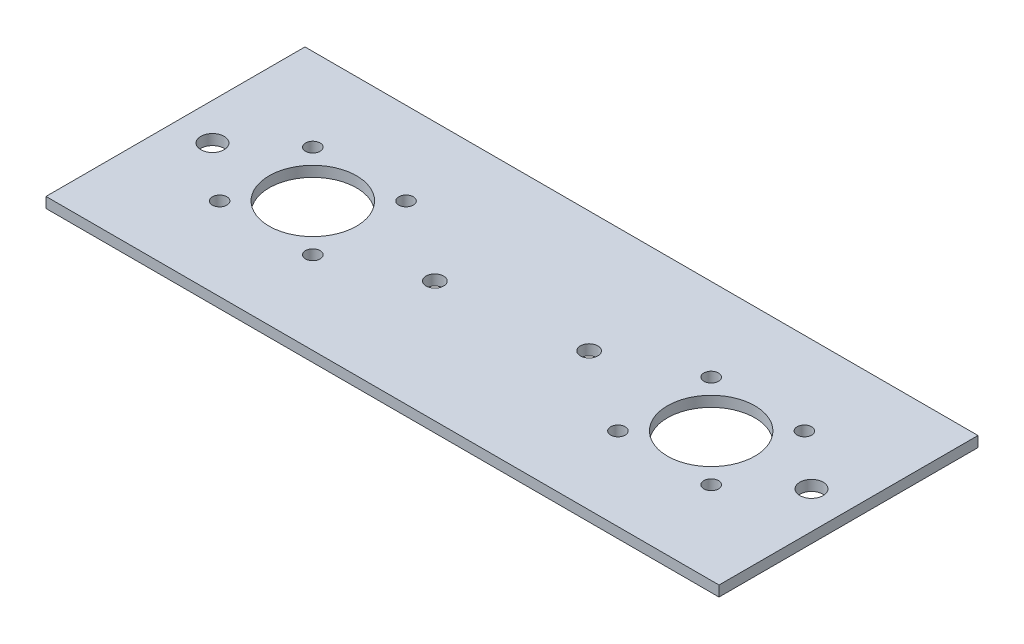
ISO-10303-21;
HEADER;
FILE_DESCRIPTION(('STEP AP214'),'2;1');
FILE_NAME('part.step','',(''),(''),'','','');
FILE_SCHEMA(('AUTOMOTIVE_DESIGN { 1 0 10303 214 1 1 1 1 }'));
ENDSEC;
DATA;
#1=APPLICATION_CONTEXT('core data for automotive mechanical design processes');
#2=APPLICATION_PROTOCOL_DEFINITION('international standard','automotive_design',2000,#1);
#3=PRODUCT_CONTEXT('',#1,'mechanical');
#4=PRODUCT('Part','Part','',(#3));
#5=PRODUCT_RELATED_PRODUCT_CATEGORY('part','',(#4));
#6=PRODUCT_DEFINITION_FORMATION('','',#4);
#7=PRODUCT_DEFINITION_CONTEXT('part definition',#1,'design');
#8=PRODUCT_DEFINITION('design','',#6,#7);
#9=PRODUCT_DEFINITION_SHAPE('','',#8);
#10=(LENGTH_UNIT() NAMED_UNIT(*) SI_UNIT(.MILLI.,.METRE.));
#11=(NAMED_UNIT(*) PLANE_ANGLE_UNIT() SI_UNIT($,.RADIAN.));
#12=(NAMED_UNIT(*) SI_UNIT($,.STERADIAN.) SOLID_ANGLE_UNIT());
#13=UNCERTAINTY_MEASURE_WITH_UNIT(LENGTH_MEASURE(1.E-05),#10,'distance_accuracy_value','');
#14=(GEOMETRIC_REPRESENTATION_CONTEXT(3) GLOBAL_UNCERTAINTY_ASSIGNED_CONTEXT((#13)) GLOBAL_UNIT_ASSIGNED_CONTEXT((#10,
#11,#12)) REPRESENTATION_CONTEXT('',''));
#15=CARTESIAN_POINT('',(0.,0.,0.));
#16=DIRECTION('',(0.,0.,1.));
#17=DIRECTION('',(1.,0.,0.));
#18=AXIS2_PLACEMENT_3D('',#15,#16,#17);
#19=CARTESIAN_POINT('',(0.,-3.6,0.));
#20=DIRECTION('',(0.,-1.,0.));
#21=DIRECTION('',(0.,0.,-1.));
#22=AXIS2_PLACEMENT_3D('',#19,#20,#21);
#23=PLANE('',#22);
#24=CARTESIAN_POINT('',(-12.7,-3.6,0.));
#25=DIRECTION('',(0.,1.,0.));
#26=DIRECTION('',(0.,0.,1.));
#27=AXIS2_PLACEMENT_3D('',#24,#25,#26);
#28=CIRCLE('',#27,3.99999999999999);
#29=CARTESIAN_POINT('',(-12.7,-3.6,3.99999999999999));
#30=VERTEX_POINT('',#29);
#31=EDGE_CURVE('E455',#30,#30,#28,.T.);
#32=ORIENTED_EDGE('',*,*,#31,.T.);
#33=EDGE_LOOP('',(#32));
#34=FACE_BOUND('',#33,.T.);
#35=CARTESIAN_POINT('',(-218.35,-3.6,0.));
#36=DIRECTION('',(0.,1.,0.));
#37=DIRECTION('',(0.,0.,1.));
#38=AXIS2_PLACEMENT_3D('',#35,#36,#37);
#39=CIRCLE('',#38,3.99999999999999);
#40=CARTESIAN_POINT('',(-218.35,-3.6,3.99999999999999));
#41=VERTEX_POINT('',#40);
#42=EDGE_CURVE('E463',#41,#41,#39,.T.);
#43=ORIENTED_EDGE('',*,*,#42,.T.);
#44=EDGE_LOOP('',(#43));
#45=FACE_BOUND('',#44,.T.);
#46=CARTESIAN_POINT('',(-91.9,-3.6,-2.85898769370838));
#47=DIRECTION('',(0.,1.,0.));
#48=DIRECTION('',(0.,0.,1.));
#49=AXIS2_PLACEMENT_3D('',#46,#47,#48);
#50=CIRCLE('',#49,3.00000000000001);
#51=CARTESIAN_POINT('',(-91.9,-3.6,0.141012306291632));
#52=VERTEX_POINT('',#51);
#53=EDGE_CURVE('E469',#52,#52,#50,.T.);
#54=ORIENTED_EDGE('',*,*,#53,.T.);
#55=EDGE_LOOP('',(#54));
#56=FACE_BOUND('',#55,.T.);
#57=CARTESIAN_POINT('',(-139.15,-3.6,2.8589876937093));
#58=DIRECTION('',(0.,1.,0.));
#59=DIRECTION('',(0.,0.,1.));
#60=AXIS2_PLACEMENT_3D('',#57,#58,#59);
#61=CIRCLE('',#60,2.99999999999999);
#62=CARTESIAN_POINT('',(-139.15,-3.6,5.85898769370929));
#63=VERTEX_POINT('',#62);
#64=EDGE_CURVE('E475',#63,#63,#61,.T.);
#65=ORIENTED_EDGE('',*,*,#64,.T.);
#66=EDGE_LOOP('',(#65));
#67=FACE_BOUND('',#66,.T.);
#68=CARTESIAN_POINT('',(-47.15,-3.6,0.));
#69=DIRECTION('',(0.,1.,0.));
#70=DIRECTION('',(0.,0.,1.));
#71=AXIS2_PLACEMENT_3D('',#68,#69,#70);
#72=CIRCLE('',#71,15.0000000000001);
#73=CARTESIAN_POINT('',(-47.15,-3.6,15.0000000000001));
#74=VERTEX_POINT('',#73);
#75=EDGE_CURVE('E481',#74,#74,#72,.T.);
#76=ORIENTED_EDGE('',*,*,#75,.T.);
#77=EDGE_LOOP('',(#76));
#78=FACE_BOUND('',#77,.T.);
#79=CARTESIAN_POINT('',(-183.9,-3.6,0.));
#80=DIRECTION('',(0.,1.,0.));
#81=DIRECTION('',(0.,0.,1.));
#82=AXIS2_PLACEMENT_3D('',#79,#80,#81);
#83=CIRCLE('',#82,14.9999999999999);
#84=CARTESIAN_POINT('',(-183.9,-3.6,14.9999999999999));
#85=VERTEX_POINT('',#84);
#86=EDGE_CURVE('E487',#85,#85,#83,.T.);
#87=ORIENTED_EDGE('',*,*,#86,.T.);
#88=EDGE_LOOP('',(#87));
#89=FACE_BOUND('',#88,.T.);
#90=CARTESIAN_POINT('',(-31.15,-3.6,-16.));
#91=DIRECTION('',(0.,1.,0.));
#92=DIRECTION('',(0.,0.,1.));
#93=AXIS2_PLACEMENT_3D('',#90,#91,#92);
#94=CIRCLE('',#93,2.49999999999999);
#95=CARTESIAN_POINT('',(-31.15,-3.6,-13.5));
#96=VERTEX_POINT('',#95);
#97=EDGE_CURVE('E493',#96,#96,#94,.T.);
#98=ORIENTED_EDGE('',*,*,#97,.T.);
#99=EDGE_LOOP('',(#98));
#100=FACE_BOUND('',#99,.T.);
#101=CARTESIAN_POINT('',(-63.15,-3.6,-16.));
#102=DIRECTION('',(0.,1.,0.));
#103=DIRECTION('',(0.,0.,1.));
#104=AXIS2_PLACEMENT_3D('',#101,#102,#103);
#105=CIRCLE('',#104,2.49999999999999);
#106=CARTESIAN_POINT('',(-63.15,-3.6,-13.5));
#107=VERTEX_POINT('',#106);
#108=EDGE_CURVE('E499',#107,#107,#105,.T.);
#109=ORIENTED_EDGE('',*,*,#108,.T.);
#110=EDGE_LOOP('',(#109));
#111=FACE_BOUND('',#110,.T.);
#112=CARTESIAN_POINT('',(-63.15,-3.6,16.000000000001));
#113=DIRECTION('',(0.,1.,0.));
#114=DIRECTION('',(0.,0.,1.));
#115=AXIS2_PLACEMENT_3D('',#112,#113,#114);
#116=CIRCLE('',#115,2.50000000000069);
#117=CARTESIAN_POINT('',(-63.15,-3.6,18.5000000000017));
#118=VERTEX_POINT('',#117);
#119=EDGE_CURVE('E505',#118,#118,#116,.T.);
#120=ORIENTED_EDGE('',*,*,#119,.T.);
#121=EDGE_LOOP('',(#120));
#122=FACE_BOUND('',#121,.T.);
#123=CARTESIAN_POINT('',(-31.15,-3.6,16.));
#124=DIRECTION('',(0.,1.,0.));
#125=DIRECTION('',(0.,0.,1.));
#126=AXIS2_PLACEMENT_3D('',#123,#124,#125);
#127=CIRCLE('',#126,2.50000000000001);
#128=CARTESIAN_POINT('',(-31.15,-3.6,18.5));
#129=VERTEX_POINT('',#128);
#130=EDGE_CURVE('E511',#129,#129,#127,.T.);
#131=ORIENTED_EDGE('',*,*,#130,.T.);
#132=EDGE_LOOP('',(#131));
#133=FACE_BOUND('',#132,.T.);
#134=CARTESIAN_POINT('',(-199.9,-3.6,-16.));
#135=DIRECTION('',(0.,-1.,0.));
#136=DIRECTION('',(0.,0.,-1.));
#137=AXIS2_PLACEMENT_3D('',#134,#135,#136);
#138=CIRCLE('',#137,2.50000000000002);
#139=CARTESIAN_POINT('',(-199.9,-3.6,-18.5));
#140=VERTEX_POINT('',#139);
#141=EDGE_CURVE('E523',#140,#140,#138,.T.);
#142=ORIENTED_EDGE('',*,*,#141,.F.);
#143=EDGE_LOOP('',(#142));
#144=FACE_BOUND('',#143,.T.);
#145=CARTESIAN_POINT('',(-167.9,-3.6,16.000000000001));
#146=DIRECTION('',(0.,-1.,0.));
#147=DIRECTION('',(0.,0.,-1.));
#148=AXIS2_PLACEMENT_3D('',#145,#146,#147);
#149=CIRCLE('',#148,2.50000000000072);
#150=CARTESIAN_POINT('',(-167.9,-3.6,13.5000000000003));
#151=VERTEX_POINT('',#150);
#152=EDGE_CURVE('E369',#151,#151,#149,.T.);
#153=ORIENTED_EDGE('',*,*,#152,.F.);
#154=EDGE_LOOP('',(#153));
#155=FACE_BOUND('',#154,.T.);
#156=DIRECTION('',(1.,0.,0.));
#157=VECTOR('',#156,1.);
#158=CARTESIAN_POINT('',(-231.05,-3.6,44.45));
#159=LINE('',#158,#157);
#160=CARTESIAN_POINT('',(-231.05,-3.6,44.45));
#161=VERTEX_POINT('',#160);
#162=CARTESIAN_POINT('',(0.,-3.6,44.45));
#163=VERTEX_POINT('',#162);
#164=EDGE_CURVE('E358',#161,#163,#159,.T.);
#165=ORIENTED_EDGE('',*,*,#164,.F.);
#166=DIRECTION('',(0.,0.,1.));
#167=VECTOR('',#166,1.);
#168=CARTESIAN_POINT('',(-231.05,-3.6,-44.45));
#169=LINE('',#168,#167);
#170=CARTESIAN_POINT('',(-231.05,-3.6,-44.45));
#171=VERTEX_POINT('',#170);
#172=EDGE_CURVE('E348',#171,#161,#169,.T.);
#173=ORIENTED_EDGE('',*,*,#172,.F.);
#174=DIRECTION('',(1.,0.,0.));
#175=VECTOR('',#174,1.);
#176=CARTESIAN_POINT('',(-231.05,-3.6,-44.45));
#177=LINE('',#176,#175);
#178=CARTESIAN_POINT('',(0.,-3.6,-44.45));
#179=VERTEX_POINT('',#178);
#180=EDGE_CURVE('E345',#171,#179,#177,.T.);
#181=ORIENTED_EDGE('',*,*,#180,.T.);
#182=DIRECTION('',(0.,0.,1.));
#183=VECTOR('',#182,1.);
#184=CARTESIAN_POINT('',(0.,-3.6,-44.45));
#185=LINE('',#184,#183);
#186=EDGE_CURVE('E342',#179,#163,#185,.T.);
#187=ORIENTED_EDGE('',*,*,#186,.T.);
#188=EDGE_LOOP('',(#165,#173,#181,#187));
#189=FACE_BOUND('',#188,.T.);
#190=CARTESIAN_POINT('',(-199.9,-3.6,16.));
#191=DIRECTION('',(0.,-1.,0.));
#192=DIRECTION('',(0.,0.,-1.));
#193=AXIS2_PLACEMENT_3D('',#190,#191,#192);
#194=CIRCLE('',#193,2.49999999999997);
#195=CARTESIAN_POINT('',(-199.9,-3.6,13.5));
#196=VERTEX_POINT('',#195);
#197=EDGE_CURVE('E529',#196,#196,#194,.T.);
#198=ORIENTED_EDGE('',*,*,#197,.F.);
#199=EDGE_LOOP('',(#198));
#200=FACE_BOUND('',#199,.T.);
#201=CARTESIAN_POINT('',(-167.9,-3.6,-16.));
#202=DIRECTION('',(0.,-1.,0.));
#203=DIRECTION('',(0.,0.,-1.));
#204=AXIS2_PLACEMENT_3D('',#201,#202,#203);
#205=CIRCLE('',#204,2.49999999999997);
#206=CARTESIAN_POINT('',(-167.9,-3.6,-18.5));
#207=VERTEX_POINT('',#206);
#208=EDGE_CURVE('E517',#207,#207,#205,.T.);
#209=ORIENTED_EDGE('',*,*,#208,.F.);
#210=EDGE_LOOP('',(#209));
#211=FACE_BOUND('',#210,.T.);
#212=ADVANCED_FACE('F299',(#34,#45,#56,#67,#78,#89,#100,#111,#122,#133,#144,#155,#189,#200,
#211),#23,.T.);
#213=CARTESIAN_POINT('',(0.,0.,0.));
#214=DIRECTION('',(0.,-1.,0.));
#215=DIRECTION('',(0.,0.,-1.));
#216=AXIS2_PLACEMENT_3D('',#213,#214,#215);
#217=PLANE('',#216);
#218=CARTESIAN_POINT('',(-12.7,0.,0.));
#219=DIRECTION('',(0.,1.,0.));
#220=DIRECTION('',(0.,0.,1.));
#221=AXIS2_PLACEMENT_3D('',#218,#219,#220);
#222=CIRCLE('',#221,3.99999999999999);
#223=CARTESIAN_POINT('',(-12.7,0.,3.99999999999999));
#224=VERTEX_POINT('',#223);
#225=EDGE_CURVE('E458',#224,#224,#222,.T.);
#226=ORIENTED_EDGE('',*,*,#225,.F.);
#227=EDGE_LOOP('',(#226));
#228=FACE_BOUND('',#227,.T.);
#229=CARTESIAN_POINT('',(-218.35,0.,0.));
#230=DIRECTION('',(0.,1.,0.));
#231=DIRECTION('',(0.,0.,1.));
#232=AXIS2_PLACEMENT_3D('',#229,#230,#231);
#233=CIRCLE('',#232,3.99999999999999);
#234=CARTESIAN_POINT('',(-218.35,0.,3.99999999999999));
#235=VERTEX_POINT('',#234);
#236=EDGE_CURVE('E460',#235,#235,#233,.T.);
#237=ORIENTED_EDGE('',*,*,#236,.F.);
#238=EDGE_LOOP('',(#237));
#239=FACE_BOUND('',#238,.T.);
#240=CARTESIAN_POINT('',(-91.9,0.,-2.85898769370838));
#241=DIRECTION('',(0.,1.,0.));
#242=DIRECTION('',(0.,0.,1.));
#243=AXIS2_PLACEMENT_3D('',#240,#241,#242);
#244=CIRCLE('',#243,3.00000000000001);
#245=CARTESIAN_POINT('',(-91.9,0.,0.141012306291632));
#246=VERTEX_POINT('',#245);
#247=EDGE_CURVE('E466',#246,#246,#244,.T.);
#248=ORIENTED_EDGE('',*,*,#247,.F.);
#249=EDGE_LOOP('',(#248));
#250=FACE_BOUND('',#249,.T.);
#251=CARTESIAN_POINT('',(-139.15,0.,2.8589876937093));
#252=DIRECTION('',(0.,1.,0.));
#253=DIRECTION('',(0.,0.,1.));
#254=AXIS2_PLACEMENT_3D('',#251,#252,#253);
#255=CIRCLE('',#254,2.99999999999999);
#256=CARTESIAN_POINT('',(-139.15,0.,5.85898769370929));
#257=VERTEX_POINT('',#256);
#258=EDGE_CURVE('E472',#257,#257,#255,.T.);
#259=ORIENTED_EDGE('',*,*,#258,.F.);
#260=EDGE_LOOP('',(#259));
#261=FACE_BOUND('',#260,.T.);
#262=CARTESIAN_POINT('',(-47.15,0.,0.));
#263=DIRECTION('',(0.,1.,0.));
#264=DIRECTION('',(0.,0.,1.));
#265=AXIS2_PLACEMENT_3D('',#262,#263,#264);
#266=CIRCLE('',#265,15.0000000000001);
#267=CARTESIAN_POINT('',(-47.15,0.,15.0000000000001));
#268=VERTEX_POINT('',#267);
#269=EDGE_CURVE('E478',#268,#268,#266,.T.);
#270=ORIENTED_EDGE('',*,*,#269,.F.);
#271=EDGE_LOOP('',(#270));
#272=FACE_BOUND('',#271,.T.);
#273=CARTESIAN_POINT('',(-183.9,0.,0.));
#274=DIRECTION('',(0.,1.,0.));
#275=DIRECTION('',(0.,0.,1.));
#276=AXIS2_PLACEMENT_3D('',#273,#274,#275);
#277=CIRCLE('',#276,14.9999999999999);
#278=CARTESIAN_POINT('',(-183.9,0.,14.9999999999999));
#279=VERTEX_POINT('',#278);
#280=EDGE_CURVE('E484',#279,#279,#277,.T.);
#281=ORIENTED_EDGE('',*,*,#280,.F.);
#282=EDGE_LOOP('',(#281));
#283=FACE_BOUND('',#282,.T.);
#284=CARTESIAN_POINT('',(-31.15,0.,-16.));
#285=DIRECTION('',(0.,1.,0.));
#286=DIRECTION('',(0.,0.,1.));
#287=AXIS2_PLACEMENT_3D('',#284,#285,#286);
#288=CIRCLE('',#287,2.49999999999999);
#289=CARTESIAN_POINT('',(-31.15,0.,-13.5));
#290=VERTEX_POINT('',#289);
#291=EDGE_CURVE('E490',#290,#290,#288,.T.);
#292=ORIENTED_EDGE('',*,*,#291,.F.);
#293=EDGE_LOOP('',(#292));
#294=FACE_BOUND('',#293,.T.);
#295=CARTESIAN_POINT('',(-63.15,0.,-16.));
#296=DIRECTION('',(0.,1.,0.));
#297=DIRECTION('',(0.,0.,1.));
#298=AXIS2_PLACEMENT_3D('',#295,#296,#297);
#299=CIRCLE('',#298,2.49999999999999);
#300=CARTESIAN_POINT('',(-63.15,0.,-13.5));
#301=VERTEX_POINT('',#300);
#302=EDGE_CURVE('E496',#301,#301,#299,.T.);
#303=ORIENTED_EDGE('',*,*,#302,.F.);
#304=EDGE_LOOP('',(#303));
#305=FACE_BOUND('',#304,.T.);
#306=CARTESIAN_POINT('',(-63.15,0.,16.000000000001));
#307=DIRECTION('',(0.,1.,0.));
#308=DIRECTION('',(0.,0.,1.));
#309=AXIS2_PLACEMENT_3D('',#306,#307,#308);
#310=CIRCLE('',#309,2.50000000000069);
#311=CARTESIAN_POINT('',(-63.15,0.,18.5000000000017));
#312=VERTEX_POINT('',#311);
#313=EDGE_CURVE('E502',#312,#312,#310,.T.);
#314=ORIENTED_EDGE('',*,*,#313,.F.);
#315=EDGE_LOOP('',(#314));
#316=FACE_BOUND('',#315,.T.);
#317=CARTESIAN_POINT('',(-31.15,0.,16.));
#318=DIRECTION('',(0.,1.,0.));
#319=DIRECTION('',(0.,0.,1.));
#320=AXIS2_PLACEMENT_3D('',#317,#318,#319);
#321=CIRCLE('',#320,2.50000000000001);
#322=CARTESIAN_POINT('',(-31.15,0.,18.5));
#323=VERTEX_POINT('',#322);
#324=EDGE_CURVE('E508',#323,#323,#321,.T.);
#325=ORIENTED_EDGE('',*,*,#324,.F.);
#326=EDGE_LOOP('',(#325));
#327=FACE_BOUND('',#326,.T.);
#328=DIRECTION('',(1.,0.,0.));
#329=VECTOR('',#328,1.);
#330=CARTESIAN_POINT('',(-231.05,0.,44.45));
#331=LINE('',#330,#329);
#332=CARTESIAN_POINT('',(-231.05,0.,44.45));
#333=VERTEX_POINT('',#332);
#334=CARTESIAN_POINT('',(0.,0.,44.45));
#335=VERTEX_POINT('',#334);
#336=EDGE_CURVE('E365',#333,#335,#331,.T.);
#337=ORIENTED_EDGE('',*,*,#336,.T.);
#338=DIRECTION('',(0.,0.,1.));
#339=VECTOR('',#338,1.);
#340=CARTESIAN_POINT('',(0.,0.,-44.45));
#341=LINE('',#340,#339);
#342=CARTESIAN_POINT('',(0.,0.,-44.45));
#343=VERTEX_POINT('',#342);
#344=EDGE_CURVE('E368',#343,#335,#341,.T.);
#345=ORIENTED_EDGE('',*,*,#344,.F.);
#346=DIRECTION('',(1.,0.,0.));
#347=VECTOR('',#346,1.);
#348=CARTESIAN_POINT('',(-231.05,0.,-44.45));
#349=LINE('',#348,#347);
#350=CARTESIAN_POINT('',(-231.05,0.,-44.45));
#351=VERTEX_POINT('',#350);
#352=EDGE_CURVE('E353',#351,#343,#349,.T.);
#353=ORIENTED_EDGE('',*,*,#352,.F.);
#354=DIRECTION('',(0.,0.,1.));
#355=VECTOR('',#354,1.);
#356=CARTESIAN_POINT('',(-231.05,0.,-44.45));
#357=LINE('',#356,#355);
#358=EDGE_CURVE('E360',#351,#333,#357,.T.);
#359=ORIENTED_EDGE('',*,*,#358,.T.);
#360=EDGE_LOOP('',(#337,#345,#353,#359));
#361=FACE_BOUND('',#360,.T.);
#362=CARTESIAN_POINT('',(-167.9,0.,16.000000000001));
#363=DIRECTION('',(0.,-1.,0.));
#364=DIRECTION('',(0.,0.,-1.));
#365=AXIS2_PLACEMENT_3D('',#362,#363,#364);
#366=CIRCLE('',#365,2.50000000000072);
#367=CARTESIAN_POINT('',(-167.9,0.,13.5000000000003));
#368=VERTEX_POINT('',#367);
#369=EDGE_CURVE('E532',#368,#368,#366,.T.);
#370=ORIENTED_EDGE('',*,*,#369,.T.);
#371=EDGE_LOOP('',(#370));
#372=FACE_BOUND('',#371,.T.);
#373=CARTESIAN_POINT('',(-199.9,0.,16.));
#374=DIRECTION('',(0.,-1.,0.));
#375=DIRECTION('',(0.,0.,-1.));
#376=AXIS2_PLACEMENT_3D('',#373,#374,#375);
#377=CIRCLE('',#376,2.49999999999997);
#378=CARTESIAN_POINT('',(-199.9,0.,13.5));
#379=VERTEX_POINT('',#378);
#380=EDGE_CURVE('E526',#379,#379,#377,.T.);
#381=ORIENTED_EDGE('',*,*,#380,.T.);
#382=EDGE_LOOP('',(#381));
#383=FACE_BOUND('',#382,.T.);
#384=CARTESIAN_POINT('',(-199.9,0.,-16.));
#385=DIRECTION('',(0.,-1.,0.));
#386=DIRECTION('',(0.,0.,-1.));
#387=AXIS2_PLACEMENT_3D('',#384,#385,#386);
#388=CIRCLE('',#387,2.50000000000002);
#389=CARTESIAN_POINT('',(-199.9,0.,-18.5));
#390=VERTEX_POINT('',#389);
#391=EDGE_CURVE('E520',#390,#390,#388,.T.);
#392=ORIENTED_EDGE('',*,*,#391,.T.);
#393=EDGE_LOOP('',(#392));
#394=FACE_BOUND('',#393,.T.);
#395=CARTESIAN_POINT('',(-167.9,0.,-16.));
#396=DIRECTION('',(0.,-1.,0.));
#397=DIRECTION('',(0.,0.,-1.));
#398=AXIS2_PLACEMENT_3D('',#395,#396,#397);
#399=CIRCLE('',#398,2.49999999999997);
#400=CARTESIAN_POINT('',(-167.9,0.,-18.5));
#401=VERTEX_POINT('',#400);
#402=EDGE_CURVE('E514',#401,#401,#399,.T.);
#403=ORIENTED_EDGE('',*,*,#402,.T.);
#404=EDGE_LOOP('',(#403));
#405=FACE_BOUND('',#404,.T.);
#406=ADVANCED_FACE('F375',(#228,#239,#250,#261,#272,#283,#294,#305,#316,#327,#361,#372,#383,
#394,#405),#217,.F.);
#407=CARTESIAN_POINT('',(-231.05,-3.6,44.45));
#408=DIRECTION('',(0.,0.,1.));
#409=DIRECTION('',(1.,0.,0.));
#410=AXIS2_PLACEMENT_3D('',#407,#408,#409);
#411=PLANE('',#410);
#412=ORIENTED_EDGE('',*,*,#336,.F.);
#413=DIRECTION('',(0.,1.,0.));
#414=VECTOR('',#413,1.);
#415=CARTESIAN_POINT('',(-231.05,-3.6,44.45));
#416=LINE('',#415,#414);
#417=EDGE_CURVE('E12',#161,#333,#416,.T.);
#418=ORIENTED_EDGE('',*,*,#417,.F.);
#419=ORIENTED_EDGE('',*,*,#164,.T.);
#420=DIRECTION('',(0.,1.,0.));
#421=VECTOR('',#420,1.);
#422=CARTESIAN_POINT('',(0.,-3.6,44.45));
#423=LINE('',#422,#421);
#424=EDGE_CURVE('E303',#163,#335,#423,.T.);
#425=ORIENTED_EDGE('',*,*,#424,.T.);
#426=EDGE_LOOP('',(#412,#418,#419,#425));
#427=FACE_BOUND('',#426,.T.);
#428=ADVANCED_FACE('F301',(#427),#411,.T.);
#429=CARTESIAN_POINT('',(-231.05,-3.6,-44.45));
#430=DIRECTION('',(-1.,0.,0.));
#431=DIRECTION('',(0.,0.,1.));
#432=AXIS2_PLACEMENT_3D('',#429,#430,#431);
#433=PLANE('',#432);
#434=ORIENTED_EDGE('',*,*,#358,.F.);
#435=DIRECTION('',(0.,1.,0.));
#436=VECTOR('',#435,1.);
#437=CARTESIAN_POINT('',(-231.05,-3.6,-44.45));
#438=LINE('',#437,#436);
#439=EDGE_CURVE('E309',#171,#351,#438,.T.);
#440=ORIENTED_EDGE('',*,*,#439,.F.);
#441=ORIENTED_EDGE('',*,*,#172,.T.);
#442=ORIENTED_EDGE('',*,*,#417,.T.);
#443=EDGE_LOOP('',(#434,#440,#441,#442));
#444=FACE_BOUND('',#443,.T.);
#445=ADVANCED_FACE('F377',(#444),#433,.T.);
#446=CARTESIAN_POINT('',(-231.05,-3.6,-44.45));
#447=DIRECTION('',(0.,0.,1.));
#448=DIRECTION('',(1.,0.,0.));
#449=AXIS2_PLACEMENT_3D('',#446,#447,#448);
#450=PLANE('',#449);
#451=ORIENTED_EDGE('',*,*,#352,.T.);
#452=DIRECTION('',(0.,1.,0.));
#453=VECTOR('',#452,1.);
#454=CARTESIAN_POINT('',(0.,-3.6,-44.45));
#455=LINE('',#454,#453);
#456=EDGE_CURVE('E351',#179,#343,#455,.T.);
#457=ORIENTED_EDGE('',*,*,#456,.F.);
#458=ORIENTED_EDGE('',*,*,#180,.F.);
#459=ORIENTED_EDGE('',*,*,#439,.T.);
#460=EDGE_LOOP('',(#451,#457,#458,#459));
#461=FACE_BOUND('',#460,.T.);
#462=ADVANCED_FACE('F352',(#461),#450,.F.);
#463=CARTESIAN_POINT('',(0.,-3.6,-44.45));
#464=DIRECTION('',(-1.,0.,0.));
#465=DIRECTION('',(0.,0.,1.));
#466=AXIS2_PLACEMENT_3D('',#463,#464,#465);
#467=PLANE('',#466);
#468=ORIENTED_EDGE('',*,*,#344,.T.);
#469=ORIENTED_EDGE('',*,*,#424,.F.);
#470=ORIENTED_EDGE('',*,*,#186,.F.);
#471=ORIENTED_EDGE('',*,*,#456,.T.);
#472=EDGE_LOOP('',(#468,#469,#470,#471));
#473=FACE_BOUND('',#472,.T.);
#474=ADVANCED_FACE('F357',(#473),#467,.F.);
#475=CARTESIAN_POINT('',(-167.9,-3.6,16.000000000001));
#476=DIRECTION('',(0.,1.,0.));
#477=DIRECTION('',(0.,0.,1.));
#478=AXIS2_PLACEMENT_3D('',#475,#476,#477);
#479=CYLINDRICAL_SURFACE('',#478,2.50000000000072);
#480=ORIENTED_EDGE('',*,*,#152,.T.);
#481=EDGE_LOOP('',(#480));
#482=FACE_BOUND('',#481,.T.);
#483=ORIENTED_EDGE('',*,*,#369,.F.);
#484=EDGE_LOOP('',(#483));
#485=FACE_BOUND('',#484,.T.);
#486=ADVANCED_FACE('F396',(#482,#485),#479,.F.);
#487=CARTESIAN_POINT('',(-199.9,-3.6,16.));
#488=DIRECTION('',(0.,1.,0.));
#489=DIRECTION('',(0.,0.,1.));
#490=AXIS2_PLACEMENT_3D('',#487,#488,#489);
#491=CYLINDRICAL_SURFACE('',#490,2.49999999999997);
#492=ORIENTED_EDGE('',*,*,#197,.T.);
#493=EDGE_LOOP('',(#492));
#494=FACE_BOUND('',#493,.T.);
#495=ORIENTED_EDGE('',*,*,#380,.F.);
#496=EDGE_LOOP('',(#495));
#497=FACE_BOUND('',#496,.T.);
#498=ADVANCED_FACE('F399',(#494,#497),#491,.F.);
#499=CARTESIAN_POINT('',(-199.9,-3.6,-16.));
#500=DIRECTION('',(0.,1.,0.));
#501=DIRECTION('',(0.,0.,1.));
#502=AXIS2_PLACEMENT_3D('',#499,#500,#501);
#503=CYLINDRICAL_SURFACE('',#502,2.50000000000002);
#504=ORIENTED_EDGE('',*,*,#141,.T.);
#505=EDGE_LOOP('',(#504));
#506=FACE_BOUND('',#505,.T.);
#507=ORIENTED_EDGE('',*,*,#391,.F.);
#508=EDGE_LOOP('',(#507));
#509=FACE_BOUND('',#508,.T.);
#510=ADVANCED_FACE('F403',(#506,#509),#503,.F.);
#511=CARTESIAN_POINT('',(-167.9,-3.6,-16.));
#512=DIRECTION('',(0.,1.,0.));
#513=DIRECTION('',(0.,0.,1.));
#514=AXIS2_PLACEMENT_3D('',#511,#512,#513);
#515=CYLINDRICAL_SURFACE('',#514,2.49999999999997);
#516=ORIENTED_EDGE('',*,*,#208,.T.);
#517=EDGE_LOOP('',(#516));
#518=FACE_BOUND('',#517,.T.);
#519=ORIENTED_EDGE('',*,*,#402,.F.);
#520=EDGE_LOOP('',(#519));
#521=FACE_BOUND('',#520,.T.);
#522=ADVANCED_FACE('F407',(#518,#521),#515,.F.);
#523=CARTESIAN_POINT('',(-31.15,-3.6,16.));
#524=DIRECTION('',(0.,1.,0.));
#525=DIRECTION('',(0.,0.,1.));
#526=AXIS2_PLACEMENT_3D('',#523,#524,#525);
#527=CYLINDRICAL_SURFACE('',#526,2.50000000000001);
#528=ORIENTED_EDGE('',*,*,#130,.F.);
#529=EDGE_LOOP('',(#528));
#530=FACE_BOUND('',#529,.T.);
#531=ORIENTED_EDGE('',*,*,#324,.T.);
#532=EDGE_LOOP('',(#531));
#533=FACE_BOUND('',#532,.T.);
#534=ADVANCED_FACE('F411',(#530,#533),#527,.F.);
#535=CARTESIAN_POINT('',(-63.15,-3.6,16.000000000001));
#536=DIRECTION('',(0.,1.,0.));
#537=DIRECTION('',(0.,0.,1.));
#538=AXIS2_PLACEMENT_3D('',#535,#536,#537);
#539=CYLINDRICAL_SURFACE('',#538,2.50000000000069);
#540=ORIENTED_EDGE('',*,*,#119,.F.);
#541=EDGE_LOOP('',(#540));
#542=FACE_BOUND('',#541,.T.);
#543=ORIENTED_EDGE('',*,*,#313,.T.);
#544=EDGE_LOOP('',(#543));
#545=FACE_BOUND('',#544,.T.);
#546=ADVANCED_FACE('F415',(#542,#545),#539,.F.);
#547=CARTESIAN_POINT('',(-63.15,-3.6,-16.));
#548=DIRECTION('',(0.,1.,0.));
#549=DIRECTION('',(0.,0.,1.));
#550=AXIS2_PLACEMENT_3D('',#547,#548,#549);
#551=CYLINDRICAL_SURFACE('',#550,2.49999999999999);
#552=ORIENTED_EDGE('',*,*,#108,.F.);
#553=EDGE_LOOP('',(#552));
#554=FACE_BOUND('',#553,.T.);
#555=ORIENTED_EDGE('',*,*,#302,.T.);
#556=EDGE_LOOP('',(#555));
#557=FACE_BOUND('',#556,.T.);
#558=ADVANCED_FACE('F419',(#554,#557),#551,.F.);
#559=CARTESIAN_POINT('',(-31.15,-3.6,-16.));
#560=DIRECTION('',(0.,1.,0.));
#561=DIRECTION('',(0.,0.,1.));
#562=AXIS2_PLACEMENT_3D('',#559,#560,#561);
#563=CYLINDRICAL_SURFACE('',#562,2.49999999999999);
#564=ORIENTED_EDGE('',*,*,#97,.F.);
#565=EDGE_LOOP('',(#564));
#566=FACE_BOUND('',#565,.T.);
#567=ORIENTED_EDGE('',*,*,#291,.T.);
#568=EDGE_LOOP('',(#567));
#569=FACE_BOUND('',#568,.T.);
#570=ADVANCED_FACE('F423',(#566,#569),#563,.F.);
#571=CARTESIAN_POINT('',(-183.9,-3.6,0.));
#572=DIRECTION('',(0.,1.,0.));
#573=DIRECTION('',(0.,0.,1.));
#574=AXIS2_PLACEMENT_3D('',#571,#572,#573);
#575=CYLINDRICAL_SURFACE('',#574,14.9999999999999);
#576=ORIENTED_EDGE('',*,*,#86,.F.);
#577=EDGE_LOOP('',(#576));
#578=FACE_BOUND('',#577,.T.);
#579=ORIENTED_EDGE('',*,*,#280,.T.);
#580=EDGE_LOOP('',(#579));
#581=FACE_BOUND('',#580,.T.);
#582=ADVANCED_FACE('F427',(#578,#581),#575,.F.);
#583=CARTESIAN_POINT('',(-47.15,-3.6,0.));
#584=DIRECTION('',(0.,1.,0.));
#585=DIRECTION('',(0.,0.,1.));
#586=AXIS2_PLACEMENT_3D('',#583,#584,#585);
#587=CYLINDRICAL_SURFACE('',#586,15.0000000000001);
#588=ORIENTED_EDGE('',*,*,#75,.F.);
#589=EDGE_LOOP('',(#588));
#590=FACE_BOUND('',#589,.T.);
#591=ORIENTED_EDGE('',*,*,#269,.T.);
#592=EDGE_LOOP('',(#591));
#593=FACE_BOUND('',#592,.T.);
#594=ADVANCED_FACE('F431',(#590,#593),#587,.F.);
#595=CARTESIAN_POINT('',(-139.15,-3.6,2.8589876937093));
#596=DIRECTION('',(0.,1.,0.));
#597=DIRECTION('',(0.,0.,1.));
#598=AXIS2_PLACEMENT_3D('',#595,#596,#597);
#599=CYLINDRICAL_SURFACE('',#598,2.99999999999999);
#600=ORIENTED_EDGE('',*,*,#64,.F.);
#601=EDGE_LOOP('',(#600));
#602=FACE_BOUND('',#601,.T.);
#603=ORIENTED_EDGE('',*,*,#258,.T.);
#604=EDGE_LOOP('',(#603));
#605=FACE_BOUND('',#604,.T.);
#606=ADVANCED_FACE('F435',(#602,#605),#599,.F.);
#607=CARTESIAN_POINT('',(-91.9,-3.6,-2.85898769370838));
#608=DIRECTION('',(0.,1.,0.));
#609=DIRECTION('',(0.,0.,1.));
#610=AXIS2_PLACEMENT_3D('',#607,#608,#609);
#611=CYLINDRICAL_SURFACE('',#610,3.00000000000001);
#612=ORIENTED_EDGE('',*,*,#53,.F.);
#613=EDGE_LOOP('',(#612));
#614=FACE_BOUND('',#613,.T.);
#615=ORIENTED_EDGE('',*,*,#247,.T.);
#616=EDGE_LOOP('',(#615));
#617=FACE_BOUND('',#616,.T.);
#618=ADVANCED_FACE('F439',(#614,#617),#611,.F.);
#619=CARTESIAN_POINT('',(-218.35,-3.6,0.));
#620=DIRECTION('',(0.,1.,0.));
#621=DIRECTION('',(0.,0.,1.));
#622=AXIS2_PLACEMENT_3D('',#619,#620,#621);
#623=CYLINDRICAL_SURFACE('',#622,3.99999999999999);
#624=ORIENTED_EDGE('',*,*,#42,.F.);
#625=EDGE_LOOP('',(#624));
#626=FACE_BOUND('',#625,.T.);
#627=ORIENTED_EDGE('',*,*,#236,.T.);
#628=EDGE_LOOP('',(#627));
#629=FACE_BOUND('',#628,.T.);
#630=ADVANCED_FACE('F443',(#626,#629),#623,.F.);
#631=CARTESIAN_POINT('',(-12.7,-3.6,0.));
#632=DIRECTION('',(0.,1.,0.));
#633=DIRECTION('',(0.,0.,1.));
#634=AXIS2_PLACEMENT_3D('',#631,#632,#633);
#635=CYLINDRICAL_SURFACE('',#634,3.99999999999999);
#636=ORIENTED_EDGE('',*,*,#31,.F.);
#637=EDGE_LOOP('',(#636));
#638=FACE_BOUND('',#637,.T.);
#639=ORIENTED_EDGE('',*,*,#225,.T.);
#640=EDGE_LOOP('',(#639));
#641=FACE_BOUND('',#640,.T.);
#642=ADVANCED_FACE('F447',(#638,#641),#635,.F.);
#643=CLOSED_SHELL('',(#212,#406,#428,#445,#462,#474,#486,#498,#510,#522,#534,#546,#558,#570,
#582,#594,#606,#618,#630,#642));
#644=MANIFOLD_SOLID_BREP('B2',#643);
#645=ADVANCED_BREP_SHAPE_REPRESENTATION('',(#18,#644),#14);
#646=SHAPE_DEFINITION_REPRESENTATION(#9,#645);
ENDSEC;
END-ISO-10303-21;
